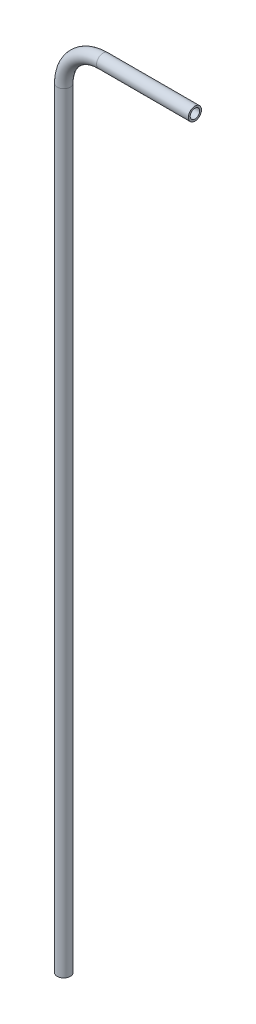
ISO-10303-21;
HEADER;
FILE_DESCRIPTION(('STEP AP214'),'2;1');
FILE_NAME('part.step','',(''),(''),'','','');
FILE_SCHEMA(('AUTOMOTIVE_DESIGN { 1 0 10303 214 1 1 1 1 }'));
ENDSEC;
DATA;
#1=APPLICATION_CONTEXT('core data for automotive mechanical design processes');
#2=APPLICATION_PROTOCOL_DEFINITION('international standard','automotive_design',2000,#1);
#3=PRODUCT_CONTEXT('',#1,'mechanical');
#4=PRODUCT('Part','Part','',(#3));
#5=PRODUCT_RELATED_PRODUCT_CATEGORY('part','',(#4));
#6=PRODUCT_DEFINITION_FORMATION('','',#4);
#7=PRODUCT_DEFINITION_CONTEXT('part definition',#1,'design');
#8=PRODUCT_DEFINITION('design','',#6,#7);
#9=PRODUCT_DEFINITION_SHAPE('','',#8);
#10=(LENGTH_UNIT() NAMED_UNIT(*) SI_UNIT(.MILLI.,.METRE.));
#11=(NAMED_UNIT(*) PLANE_ANGLE_UNIT() SI_UNIT($,.RADIAN.));
#12=(NAMED_UNIT(*) SI_UNIT($,.STERADIAN.) SOLID_ANGLE_UNIT());
#13=UNCERTAINTY_MEASURE_WITH_UNIT(LENGTH_MEASURE(1.E-05),#10,'distance_accuracy_value','');
#14=(GEOMETRIC_REPRESENTATION_CONTEXT(3) GLOBAL_UNCERTAINTY_ASSIGNED_CONTEXT((#13)) GLOBAL_UNIT_ASSIGNED_CONTEXT((#10,
#11,#12)) REPRESENTATION_CONTEXT('',''));
#15=CARTESIAN_POINT('',(0.,0.,0.));
#16=DIRECTION('',(0.,0.,1.));
#17=DIRECTION('',(1.,0.,0.));
#18=AXIS2_PLACEMENT_3D('',#15,#16,#17);
#19=CARTESIAN_POINT('',(0.,-374.394317880795,0.));
#20=DIRECTION('',(0.,1.,0.));
#21=DIRECTION('',(0.,0.,1.));
#22=AXIS2_PLACEMENT_3D('',#19,#20,#21);
#23=CYLINDRICAL_SURFACE('',#22,3.175);
#24=CARTESIAN_POINT('',(0.,-1.52231788079493,0.));
#25=DIRECTION('',(0.,1.,0.));
#26=DIRECTION('',(0.,0.,-1.));
#27=AXIS2_PLACEMENT_3D('',#24,#25,#26);
#28=CIRCLE('',#27,3.175);
#29=CARTESIAN_POINT('',(-3.175,-1.52231788079497,0.));
#30=VERTEX_POINT('',#29);
#31=EDGE_CURVE('E90',#30,#30,#28,.T.);
#32=ORIENTED_EDGE('',*,*,#31,.F.);
#33=EDGE_LOOP('',(#32));
#34=FACE_BOUND('',#33,.T.);
#35=CARTESIAN_POINT('',(0.,-374.394317880795,0.));
#36=DIRECTION('',(0.,1.,0.));
#37=DIRECTION('',(0.,0.,-1.));
#38=AXIS2_PLACEMENT_3D('',#35,#36,#37);
#39=CIRCLE('',#38,3.175);
#40=CARTESIAN_POINT('',(0.,-374.394317880795,-3.175));
#41=VERTEX_POINT('',#40);
#42=EDGE_CURVE('E55',#41,#41,#39,.T.);
#43=ORIENTED_EDGE('',*,*,#42,.T.);
#44=EDGE_LOOP('',(#43));
#45=FACE_BOUND('',#44,.T.);
#46=ADVANCED_FACE('F39',(#34,#45),#23,.T.);
#47=CARTESIAN_POINT('',(19.05,-1.52231788079469,0.));
#48=DIRECTION('',(0.,0.,-1.));
#49=DIRECTION('',(-1.,0.,0.));
#50=AXIS2_PLACEMENT_3D('',#47,#48,#49);
#51=TOROIDAL_SURFACE('',#50,19.05,3.175);
#52=CARTESIAN_POINT('',(19.05,17.5276821192058,0.));
#53=DIRECTION('',(1.,0.,0.));
#54=DIRECTION('',(0.,0.,-1.));
#55=AXIS2_PLACEMENT_3D('',#52,#53,#54);
#56=CIRCLE('',#55,3.175);
#57=CARTESIAN_POINT('',(19.05,20.7026821192053,0.));
#58=VERTEX_POINT('',#57);
#59=EDGE_CURVE('E43',#58,#58,#56,.T.);
#60=CARTESIAN_POINT('',(19.05,-1.52231788079469,0.));
#61=DIRECTION('',(0.,0.,-1.));
#62=DIRECTION('',(-1.,0.,0.));
#63=AXIS2_PLACEMENT_3D('',#60,#61,#62);
#64=CIRCLE('',#63,22.225);
#65=EDGE_CURVE('',#30,#58,#64,.T.);
#66=ORIENTED_EDGE('',*,*,#31,.T.);
#67=ORIENTED_EDGE('',*,*,#59,.F.);
#68=ORIENTED_EDGE('',*,*,#65,.T.);
#69=ORIENTED_EDGE('',*,*,#65,.F.);
#70=EDGE_LOOP('',(#66,#68,#67,#69));
#71=FACE_BOUND('',#70,.T.);
#72=ADVANCED_FACE('F100',(#71),#51,.T.);
#73=CARTESIAN_POINT('',(19.0500000000001,17.5276821192053,0.));
#74=DIRECTION('',(1.,0.,0.));
#75=DIRECTION('',(0.,0.,-1.));
#76=AXIS2_PLACEMENT_3D('',#73,#74,#75);
#77=CYLINDRICAL_SURFACE('',#76,3.175);
#78=CARTESIAN_POINT('',(63.5,17.5276821192053,0.));
#79=DIRECTION('',(1.,0.,0.));
#80=DIRECTION('',(0.,0.,-1.));
#81=AXIS2_PLACEMENT_3D('',#78,#79,#80);
#82=CIRCLE('',#81,3.175);
#83=CARTESIAN_POINT('',(63.5,17.5276821192053,-3.175));
#84=VERTEX_POINT('',#83);
#85=EDGE_CURVE('E60',#84,#84,#82,.T.);
#86=ORIENTED_EDGE('',*,*,#85,.F.);
#87=EDGE_LOOP('',(#86));
#88=FACE_BOUND('',#87,.T.);
#89=ORIENTED_EDGE('',*,*,#59,.T.);
#90=EDGE_LOOP('',(#89));
#91=FACE_BOUND('',#90,.T.);
#92=ADVANCED_FACE('F41',(#88,#91),#77,.T.);
#93=CARTESIAN_POINT('',(0.,-374.394317880795,0.));
#94=DIRECTION('',(0.,1.,0.));
#95=DIRECTION('',(0.,0.,-1.));
#96=AXIS2_PLACEMENT_3D('',#93,#94,#95);
#97=PLANE('',#96);
#98=CARTESIAN_POINT('',(0.,-374.394317880795,0.));
#99=DIRECTION('',(0.,1.,0.));
#100=DIRECTION('',(0.,0.,-1.));
#101=AXIS2_PLACEMENT_3D('',#98,#99,#100);
#102=CIRCLE('',#101,2.286);
#103=CARTESIAN_POINT('',(0.,-374.394317880795,-2.286));
#104=VERTEX_POINT('',#103);
#105=EDGE_CURVE('E83',#104,#104,#102,.F.);
#106=ORIENTED_EDGE('',*,*,#105,.F.);
#107=EDGE_LOOP('',(#106));
#108=FACE_BOUND('',#107,.T.);
#109=ORIENTED_EDGE('',*,*,#42,.F.);
#110=EDGE_LOOP('',(#109));
#111=FACE_BOUND('',#110,.T.);
#112=ADVANCED_FACE('F106',(#108,#111),#97,.F.);
#113=CARTESIAN_POINT('',(63.5,17.5276821192053,0.));
#114=DIRECTION('',(1.,0.,0.));
#115=DIRECTION('',(0.,0.,-1.));
#116=AXIS2_PLACEMENT_3D('',#113,#114,#115);
#117=PLANE('',#116);
#118=CARTESIAN_POINT('',(63.5,17.5276821192053,0.));
#119=DIRECTION('',(1.,0.,0.));
#120=DIRECTION('',(0.,0.,-1.));
#121=AXIS2_PLACEMENT_3D('',#118,#119,#120);
#122=CIRCLE('',#121,2.286);
#123=CARTESIAN_POINT('',(63.5,17.5276821192053,-2.286));
#124=VERTEX_POINT('',#123);
#125=EDGE_CURVE('E11',#124,#124,#122,.F.);
#126=ORIENTED_EDGE('',*,*,#125,.T.);
#127=EDGE_LOOP('',(#126));
#128=FACE_BOUND('',#127,.T.);
#129=ORIENTED_EDGE('',*,*,#85,.T.);
#130=EDGE_LOOP('',(#129));
#131=FACE_BOUND('',#130,.T.);
#132=ADVANCED_FACE('F67',(#128,#131),#117,.T.);
#133=CARTESIAN_POINT('',(0.,-374.394317880795,0.));
#134=DIRECTION('',(0.,1.,0.));
#135=DIRECTION('',(0.,0.,1.));
#136=AXIS2_PLACEMENT_3D('',#133,#134,#135);
#137=CYLINDRICAL_SURFACE('',#136,2.286);
#138=CARTESIAN_POINT('',(0.,-1.52231788079493,0.));
#139=DIRECTION('',(0.,1.,0.));
#140=DIRECTION('',(0.,0.,-1.));
#141=AXIS2_PLACEMENT_3D('',#138,#139,#140);
#142=CIRCLE('',#141,2.286);
#143=CARTESIAN_POINT('',(-2.286,-1.52231788079496,0.));
#144=VERTEX_POINT('',#143);
#145=EDGE_CURVE('E79',#144,#144,#142,.F.);
#146=ORIENTED_EDGE('',*,*,#145,.F.);
#147=EDGE_LOOP('',(#146));
#148=FACE_BOUND('',#147,.T.);
#149=ORIENTED_EDGE('',*,*,#105,.T.);
#150=EDGE_LOOP('',(#149));
#151=FACE_BOUND('',#150,.T.);
#152=ADVANCED_FACE('F114',(#148,#151),#137,.F.);
#153=CARTESIAN_POINT('',(19.05,-1.52231788079469,0.));
#154=DIRECTION('',(0.,0.,-1.));
#155=DIRECTION('',(-1.,0.,0.));
#156=AXIS2_PLACEMENT_3D('',#153,#154,#155);
#157=TOROIDAL_SURFACE('',#156,19.05,2.286);
#158=CARTESIAN_POINT('',(19.05,17.5276821192058,0.));
#159=DIRECTION('',(1.,0.,0.));
#160=DIRECTION('',(0.,0.,-1.));
#161=AXIS2_PLACEMENT_3D('',#158,#159,#160);
#162=CIRCLE('',#161,2.286);
#163=CARTESIAN_POINT('',(19.05,19.8136821192053,0.));
#164=VERTEX_POINT('',#163);
#165=EDGE_CURVE('E49',#164,#164,#162,.F.);
#166=CARTESIAN_POINT('',(19.05,-1.52231788079469,0.));
#167=DIRECTION('',(0.,0.,-1.));
#168=DIRECTION('',(-1.,0.,0.));
#169=AXIS2_PLACEMENT_3D('',#166,#167,#168);
#170=CIRCLE('',#169,21.336);
#171=EDGE_CURVE('',#144,#164,#170,.T.);
#172=ORIENTED_EDGE('',*,*,#145,.T.);
#173=ORIENTED_EDGE('',*,*,#165,.F.);
#174=ORIENTED_EDGE('',*,*,#171,.T.);
#175=ORIENTED_EDGE('',*,*,#171,.F.);
#176=EDGE_LOOP('',(#172,#174,#173,#175));
#177=FACE_BOUND('',#176,.T.);
#178=ADVANCED_FACE('F73',(#177),#157,.F.);
#179=CARTESIAN_POINT('',(19.0500000000001,17.5276821192053,0.));
#180=DIRECTION('',(1.,0.,0.));
#181=DIRECTION('',(0.,0.,-1.));
#182=AXIS2_PLACEMENT_3D('',#179,#180,#181);
#183=CYLINDRICAL_SURFACE('',#182,2.286);
#184=ORIENTED_EDGE('',*,*,#125,.F.);
#185=EDGE_LOOP('',(#184));
#186=FACE_BOUND('',#185,.T.);
#187=ORIENTED_EDGE('',*,*,#165,.T.);
#188=EDGE_LOOP('',(#187));
#189=FACE_BOUND('',#188,.T.);
#190=ADVANCED_FACE('F70',(#186,#189),#183,.F.);
#191=CLOSED_SHELL('',(#46,#72,#92,#112,#132,#152,#178,#190));
#192=MANIFOLD_SOLID_BREP('B2',#191);
#193=ADVANCED_BREP_SHAPE_REPRESENTATION('',(#18,#192),#14);
#194=SHAPE_DEFINITION_REPRESENTATION(#9,#193);
ENDSEC;
END-ISO-10303-21;
